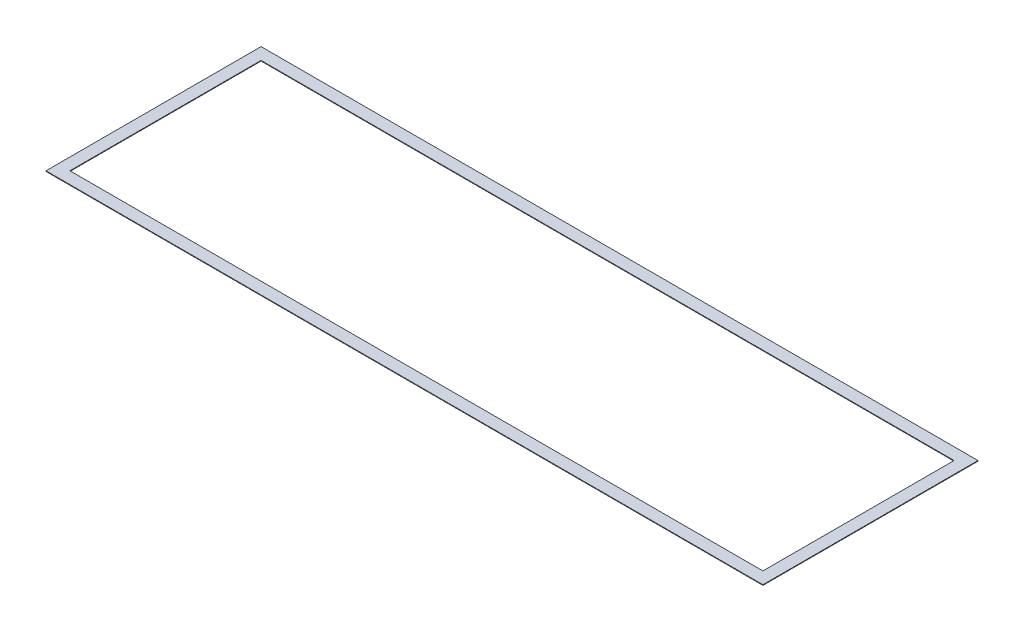
ISO-10303-21;
HEADER;
FILE_DESCRIPTION(('STEP AP214'),'2;1');
FILE_NAME('part.step','',(''),(''),'','','');
FILE_SCHEMA(('AUTOMOTIVE_DESIGN { 1 0 10303 214 1 1 1 1 }'));
ENDSEC;
DATA;
#1=APPLICATION_CONTEXT('core data for automotive mechanical design processes');
#2=APPLICATION_PROTOCOL_DEFINITION('international standard','automotive_design',2000,#1);
#3=PRODUCT_CONTEXT('',#1,'mechanical');
#4=PRODUCT('Part','Part','',(#3));
#5=PRODUCT_RELATED_PRODUCT_CATEGORY('part','',(#4));
#6=PRODUCT_DEFINITION_FORMATION('','',#4);
#7=PRODUCT_DEFINITION_CONTEXT('part definition',#1,'design');
#8=PRODUCT_DEFINITION('design','',#6,#7);
#9=PRODUCT_DEFINITION_SHAPE('','',#8);
#10=(LENGTH_UNIT() NAMED_UNIT(*) SI_UNIT(.MILLI.,.METRE.));
#11=(NAMED_UNIT(*) PLANE_ANGLE_UNIT() SI_UNIT($,.RADIAN.));
#12=(NAMED_UNIT(*) SI_UNIT($,.STERADIAN.) SOLID_ANGLE_UNIT());
#13=UNCERTAINTY_MEASURE_WITH_UNIT(LENGTH_MEASURE(1.E-05),#10,'distance_accuracy_value','');
#14=(GEOMETRIC_REPRESENTATION_CONTEXT(3) GLOBAL_UNCERTAINTY_ASSIGNED_CONTEXT((#13)) GLOBAL_UNIT_ASSIGNED_CONTEXT((#10,
#11,#12)) REPRESENTATION_CONTEXT('',''));
#15=CARTESIAN_POINT('',(0.,0.,0.));
#16=DIRECTION('',(0.,0.,1.));
#17=DIRECTION('',(1.,0.,0.));
#18=AXIS2_PLACEMENT_3D('',#15,#16,#17);
#19=CARTESIAN_POINT('',(0.,0.,0.));
#20=DIRECTION('',(0.,1.,0.));
#21=DIRECTION('',(0.,0.,1.));
#22=AXIS2_PLACEMENT_3D('',#19,#20,#21);
#23=PLANE('',#22);
#24=DIRECTION('',(-1.,0.,0.));
#25=VECTOR('',#24,1.);
#26=CARTESIAN_POINT('',(1473.2,0.,406.4));
#27=LINE('',#26,#25);
#28=CARTESIAN_POINT('',(1473.2,0.,406.4));
#29=VERTEX_POINT('',#28);
#30=CARTESIAN_POINT('',(-1473.2,0.,406.4));
#31=VERTEX_POINT('',#30);
#32=EDGE_CURVE('E108',#29,#31,#27,.T.);
#33=ORIENTED_EDGE('',*,*,#32,.F.);
#34=DIRECTION('',(0.,0.,1.));
#35=VECTOR('',#34,1.);
#36=CARTESIAN_POINT('',(1473.2,0.,406.4));
#37=LINE('',#36,#35);
#38=CARTESIAN_POINT('',(1473.2,0.,-406.4));
#39=VERTEX_POINT('',#38);
#40=EDGE_CURVE('E122',#39,#29,#37,.T.);
#41=ORIENTED_EDGE('',*,*,#40,.F.);
#42=DIRECTION('',(1.,0.,0.));
#43=VECTOR('',#42,1.);
#44=CARTESIAN_POINT('',(1473.2,0.,-406.4));
#45=LINE('',#44,#43);
#46=CARTESIAN_POINT('',(-1473.2,0.,-406.4));
#47=VERTEX_POINT('',#46);
#48=EDGE_CURVE('E117',#47,#39,#45,.T.);
#49=ORIENTED_EDGE('',*,*,#48,.F.);
#50=DIRECTION('',(0.,0.,-1.));
#51=VECTOR('',#50,1.);
#52=CARTESIAN_POINT('',(-1473.2,0.,406.4));
#53=LINE('',#52,#51);
#54=EDGE_CURVE('E111',#31,#47,#53,.T.);
#55=ORIENTED_EDGE('',*,*,#54,.F.);
#56=EDGE_LOOP('',(#33,#41,#49,#55));
#57=FACE_BOUND('',#56,.T.);
#58=DIRECTION('',(-1.,0.,0.));
#59=VECTOR('',#58,1.);
#60=CARTESIAN_POINT('',(1524.,0.,457.2));
#61=LINE('',#60,#59);
#62=CARTESIAN_POINT('',(1524.,0.,457.2));
#63=VERTEX_POINT('',#62);
#64=CARTESIAN_POINT('',(-1524.,0.,457.2));
#65=VERTEX_POINT('',#64);
#66=EDGE_CURVE('E106',#63,#65,#61,.T.);
#67=ORIENTED_EDGE('',*,*,#66,.T.);
#68=DIRECTION('',(0.,0.,-1.));
#69=VECTOR('',#68,1.);
#70=CARTESIAN_POINT('',(-1524.,0.,457.2));
#71=LINE('',#70,#69);
#72=CARTESIAN_POINT('',(-1524.,0.,-457.2));
#73=VERTEX_POINT('',#72);
#74=EDGE_CURVE('E92',#65,#73,#71,.T.);
#75=ORIENTED_EDGE('',*,*,#74,.T.);
#76=DIRECTION('',(1.,0.,0.));
#77=VECTOR('',#76,1.);
#78=CARTESIAN_POINT('',(1524.,0.,-457.2));
#79=LINE('',#78,#77);
#80=CARTESIAN_POINT('',(1524.,0.,-457.2));
#81=VERTEX_POINT('',#80);
#82=EDGE_CURVE('E79',#73,#81,#79,.T.);
#83=ORIENTED_EDGE('',*,*,#82,.T.);
#84=DIRECTION('',(0.,0.,1.));
#85=VECTOR('',#84,1.);
#86=CARTESIAN_POINT('',(1524.,0.,457.2));
#87=LINE('',#86,#85);
#88=EDGE_CURVE('E19',#81,#63,#87,.T.);
#89=ORIENTED_EDGE('',*,*,#88,.T.);
#90=EDGE_LOOP('',(#67,#75,#83,#89));
#91=FACE_BOUND('',#90,.T.);
#92=ADVANCED_FACE('F16',(#57,#91),#23,.F.);
#93=CARTESIAN_POINT('',(1524.,2.54,457.2));
#94=DIRECTION('',(-1.,0.,0.));
#95=DIRECTION('',(0.,0.,1.));
#96=AXIS2_PLACEMENT_3D('',#93,#94,#95);
#97=PLANE('',#96);
#98=DIRECTION('',(0.,1.,0.));
#99=VECTOR('',#98,1.);
#100=CARTESIAN_POINT('',(1524.,2.54,-457.2));
#101=LINE('',#100,#99);
#102=CARTESIAN_POINT('',(1524.,2.54,-457.2));
#103=VERTEX_POINT('',#102);
#104=EDGE_CURVE('E85',#81,#103,#101,.T.);
#105=ORIENTED_EDGE('',*,*,#104,.T.);
#106=DIRECTION('',(0.,0.,1.));
#107=VECTOR('',#106,1.);
#108=CARTESIAN_POINT('',(1524.,2.54,0.));
#109=LINE('',#108,#107);
#110=CARTESIAN_POINT('',(1524.,2.54,457.2));
#111=VERTEX_POINT('',#110);
#112=EDGE_CURVE('E129',#111,#103,#109,.F.);
#113=ORIENTED_EDGE('',*,*,#112,.F.);
#114=DIRECTION('',(0.,1.,0.));
#115=VECTOR('',#114,1.);
#116=CARTESIAN_POINT('',(1524.,2.54,457.2));
#117=LINE('',#116,#115);
#118=EDGE_CURVE('E88',#111,#63,#117,.F.);
#119=ORIENTED_EDGE('',*,*,#118,.T.);
#120=ORIENTED_EDGE('',*,*,#88,.F.);
#121=EDGE_LOOP('',(#105,#113,#119,#120));
#122=FACE_BOUND('',#121,.T.);
#123=ADVANCED_FACE('F84',(#122),#97,.F.);
#124=CARTESIAN_POINT('',(1524.,2.54,-457.2));
#125=DIRECTION('',(0.,0.,1.));
#126=DIRECTION('',(1.,0.,0.));
#127=AXIS2_PLACEMENT_3D('',#124,#125,#126);
#128=PLANE('',#127);
#129=DIRECTION('',(0.,1.,0.));
#130=VECTOR('',#129,1.);
#131=CARTESIAN_POINT('',(-1524.,2.54,-457.2));
#132=LINE('',#131,#130);
#133=CARTESIAN_POINT('',(-1524.,2.54,-457.2));
#134=VERTEX_POINT('',#133);
#135=EDGE_CURVE('E94',#73,#134,#132,.T.);
#136=ORIENTED_EDGE('',*,*,#135,.T.);
#137=DIRECTION('',(1.,0.,0.));
#138=VECTOR('',#137,1.);
#139=CARTESIAN_POINT('',(0.,2.54,-457.2));
#140=LINE('',#139,#138);
#141=EDGE_CURVE('E98',#103,#134,#140,.F.);
#142=ORIENTED_EDGE('',*,*,#141,.F.);
#143=ORIENTED_EDGE('',*,*,#104,.F.);
#144=ORIENTED_EDGE('',*,*,#82,.F.);
#145=EDGE_LOOP('',(#136,#142,#143,#144));
#146=FACE_BOUND('',#145,.T.);
#147=ADVANCED_FACE('F96',(#146),#128,.F.);
#148=CARTESIAN_POINT('',(-1524.,2.54,457.2));
#149=DIRECTION('',(1.,0.,0.));
#150=DIRECTION('',(0.,0.,-1.));
#151=AXIS2_PLACEMENT_3D('',#148,#149,#150);
#152=PLANE('',#151);
#153=DIRECTION('',(0.,1.,0.));
#154=VECTOR('',#153,1.);
#155=CARTESIAN_POINT('',(-1524.,2.54,457.2));
#156=LINE('',#155,#154);
#157=CARTESIAN_POINT('',(-1524.,2.54,457.2));
#158=VERTEX_POINT('',#157);
#159=EDGE_CURVE('E103',#65,#158,#156,.T.);
#160=ORIENTED_EDGE('',*,*,#159,.T.);
#161=DIRECTION('',(0.,0.,1.));
#162=VECTOR('',#161,1.);
#163=CARTESIAN_POINT('',(-1524.,2.54,0.));
#164=LINE('',#163,#162);
#165=EDGE_CURVE('E132',#134,#158,#164,.T.);
#166=ORIENTED_EDGE('',*,*,#165,.F.);
#167=ORIENTED_EDGE('',*,*,#135,.F.);
#168=ORIENTED_EDGE('',*,*,#74,.F.);
#169=EDGE_LOOP('',(#160,#166,#167,#168));
#170=FACE_BOUND('',#169,.T.);
#171=ADVANCED_FACE('F175',(#170),#152,.F.);
#172=CARTESIAN_POINT('',(1524.,2.54,457.2));
#173=DIRECTION('',(0.,0.,-1.));
#174=DIRECTION('',(-1.,0.,0.));
#175=AXIS2_PLACEMENT_3D('',#172,#173,#174);
#176=PLANE('',#175);
#177=ORIENTED_EDGE('',*,*,#118,.F.);
#178=DIRECTION('',(1.,0.,0.));
#179=VECTOR('',#178,1.);
#180=CARTESIAN_POINT('',(0.,2.54,457.2));
#181=LINE('',#180,#179);
#182=EDGE_CURVE('E135',#158,#111,#181,.T.);
#183=ORIENTED_EDGE('',*,*,#182,.F.);
#184=ORIENTED_EDGE('',*,*,#159,.F.);
#185=ORIENTED_EDGE('',*,*,#66,.F.);
#186=EDGE_LOOP('',(#177,#183,#184,#185));
#187=FACE_BOUND('',#186,.T.);
#188=ADVANCED_FACE('F172',(#187),#176,.F.);
#189=CARTESIAN_POINT('',(1473.2,2.54,406.4));
#190=DIRECTION('',(0.,0.,-1.));
#191=DIRECTION('',(-1.,0.,0.));
#192=AXIS2_PLACEMENT_3D('',#189,#190,#191);
#193=PLANE('',#192);
#194=DIRECTION('',(1.,0.,0.));
#195=VECTOR('',#194,1.);
#196=CARTESIAN_POINT('',(0.,2.54,406.4));
#197=LINE('',#196,#195);
#198=CARTESIAN_POINT('',(1473.2,2.54,406.4));
#199=VERTEX_POINT('',#198);
#200=CARTESIAN_POINT('',(-1473.2,2.54,406.4));
#201=VERTEX_POINT('',#200);
#202=EDGE_CURVE('E138',#199,#201,#197,.F.);
#203=ORIENTED_EDGE('',*,*,#202,.F.);
#204=DIRECTION('',(0.,1.,0.));
#205=VECTOR('',#204,1.);
#206=CARTESIAN_POINT('',(1473.2,2.54,406.4));
#207=LINE('',#206,#205);
#208=EDGE_CURVE('E125',#29,#199,#207,.T.);
#209=ORIENTED_EDGE('',*,*,#208,.F.);
#210=ORIENTED_EDGE('',*,*,#32,.T.);
#211=DIRECTION('',(0.,1.,0.));
#212=VECTOR('',#211,1.);
#213=CARTESIAN_POINT('',(-1473.2,2.54,406.4));
#214=LINE('',#213,#212);
#215=EDGE_CURVE('E114',#201,#31,#214,.F.);
#216=ORIENTED_EDGE('',*,*,#215,.F.);
#217=EDGE_LOOP('',(#203,#209,#210,#216));
#218=FACE_BOUND('',#217,.T.);
#219=ADVANCED_FACE('F155',(#218),#193,.T.);
#220=CARTESIAN_POINT('',(-1473.2,2.54,406.4));
#221=DIRECTION('',(1.,0.,0.));
#222=DIRECTION('',(0.,0.,-1.));
#223=AXIS2_PLACEMENT_3D('',#220,#221,#222);
#224=PLANE('',#223);
#225=DIRECTION('',(0.,0.,1.));
#226=VECTOR('',#225,1.);
#227=CARTESIAN_POINT('',(-1473.2,2.54,0.));
#228=LINE('',#227,#226);
#229=CARTESIAN_POINT('',(-1473.2,2.54,-406.4));
#230=VERTEX_POINT('',#229);
#231=EDGE_CURVE('E141',#201,#230,#228,.F.);
#232=ORIENTED_EDGE('',*,*,#231,.F.);
#233=ORIENTED_EDGE('',*,*,#215,.T.);
#234=ORIENTED_EDGE('',*,*,#54,.T.);
#235=DIRECTION('',(0.,1.,0.));
#236=VECTOR('',#235,1.);
#237=CARTESIAN_POINT('',(-1473.2,2.54,-406.4));
#238=LINE('',#237,#236);
#239=EDGE_CURVE('E119',#230,#47,#238,.F.);
#240=ORIENTED_EDGE('',*,*,#239,.F.);
#241=EDGE_LOOP('',(#232,#233,#234,#240));
#242=FACE_BOUND('',#241,.T.);
#243=ADVANCED_FACE('F151',(#242),#224,.T.);
#244=CARTESIAN_POINT('',(1473.2,2.54,-406.4));
#245=DIRECTION('',(0.,0.,1.));
#246=DIRECTION('',(1.,0.,0.));
#247=AXIS2_PLACEMENT_3D('',#244,#245,#246);
#248=PLANE('',#247);
#249=DIRECTION('',(1.,0.,0.));
#250=VECTOR('',#249,1.);
#251=CARTESIAN_POINT('',(0.,2.54,-406.4));
#252=LINE('',#251,#250);
#253=CARTESIAN_POINT('',(1473.2,2.54,-406.4));
#254=VERTEX_POINT('',#253);
#255=EDGE_CURVE('E25',#230,#254,#252,.T.);
#256=ORIENTED_EDGE('',*,*,#255,.F.);
#257=ORIENTED_EDGE('',*,*,#239,.T.);
#258=ORIENTED_EDGE('',*,*,#48,.T.);
#259=DIRECTION('',(0.,1.,0.));
#260=VECTOR('',#259,1.);
#261=CARTESIAN_POINT('',(1473.2,2.54,-406.4));
#262=LINE('',#261,#260);
#263=EDGE_CURVE('E34',#254,#39,#262,.F.);
#264=ORIENTED_EDGE('',*,*,#263,.F.);
#265=EDGE_LOOP('',(#256,#257,#258,#264));
#266=FACE_BOUND('',#265,.T.);
#267=ADVANCED_FACE('F149',(#266),#248,.T.);
#268=CARTESIAN_POINT('',(1473.2,2.54,406.4));
#269=DIRECTION('',(-1.,0.,0.));
#270=DIRECTION('',(0.,0.,1.));
#271=AXIS2_PLACEMENT_3D('',#268,#269,#270);
#272=PLANE('',#271);
#273=DIRECTION('',(0.,0.,1.));
#274=VECTOR('',#273,1.);
#275=CARTESIAN_POINT('',(1473.2,2.54,0.));
#276=LINE('',#275,#274);
#277=EDGE_CURVE('E11',#254,#199,#276,.T.);
#278=ORIENTED_EDGE('',*,*,#277,.F.);
#279=ORIENTED_EDGE('',*,*,#263,.T.);
#280=ORIENTED_EDGE('',*,*,#40,.T.);
#281=ORIENTED_EDGE('',*,*,#208,.T.);
#282=EDGE_LOOP('',(#278,#279,#280,#281));
#283=FACE_BOUND('',#282,.T.);
#284=ADVANCED_FACE('F157',(#283),#272,.T.);
#285=CARTESIAN_POINT('',(0.,2.54,0.));
#286=DIRECTION('',(0.,1.,0.));
#287=DIRECTION('',(0.,0.,1.));
#288=AXIS2_PLACEMENT_3D('',#285,#286,#287);
#289=PLANE('',#288);
#290=ORIENTED_EDGE('',*,*,#255,.T.);
#291=ORIENTED_EDGE('',*,*,#277,.T.);
#292=ORIENTED_EDGE('',*,*,#202,.T.);
#293=ORIENTED_EDGE('',*,*,#231,.T.);
#294=EDGE_LOOP('',(#290,#291,#292,#293));
#295=FACE_BOUND('',#294,.T.);
#296=ORIENTED_EDGE('',*,*,#165,.T.);
#297=ORIENTED_EDGE('',*,*,#182,.T.);
#298=ORIENTED_EDGE('',*,*,#112,.T.);
#299=ORIENTED_EDGE('',*,*,#141,.T.);
#300=EDGE_LOOP('',(#296,#297,#298,#299));
#301=FACE_BOUND('',#300,.T.);
#302=ADVANCED_FACE('F146',(#295,#301),#289,.T.);
#303=CLOSED_SHELL('',(#92,#123,#147,#171,#188,#219,#243,#267,#284,#302));
#304=MANIFOLD_SOLID_BREP('B1',#303);
#305=ADVANCED_BREP_SHAPE_REPRESENTATION('',(#18,#304),#14);
#306=SHAPE_DEFINITION_REPRESENTATION(#9,#305);
ENDSEC;
END-ISO-10303-21;
